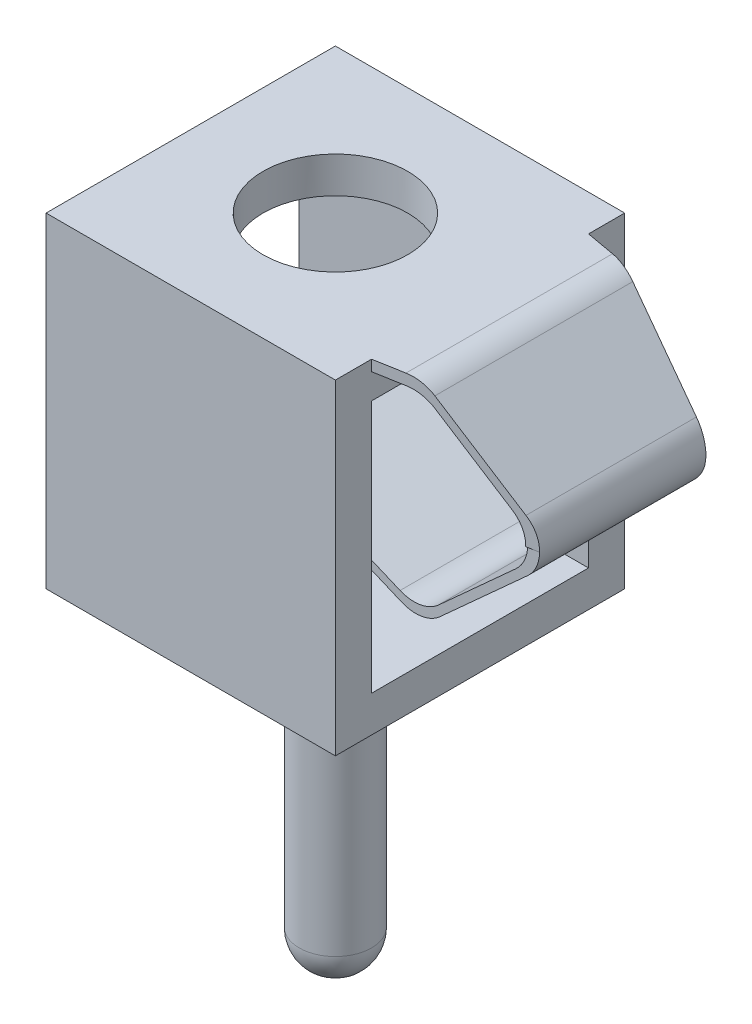
ISO-10303-21;
HEADER;
FILE_DESCRIPTION(('STEP AP214'),'2;1');
FILE_NAME('part.step','',(''),(''),'','','');
FILE_SCHEMA(('AUTOMOTIVE_DESIGN { 1 0 10303 214 1 1 1 1 }'));
ENDSEC;
DATA;
#1=APPLICATION_CONTEXT('core data for automotive mechanical design processes');
#2=APPLICATION_PROTOCOL_DEFINITION('international standard','automotive_design',2000,#1);
#3=PRODUCT_CONTEXT('',#1,'mechanical');
#4=PRODUCT('Part','Part','',(#3));
#5=PRODUCT_RELATED_PRODUCT_CATEGORY('part','',(#4));
#6=PRODUCT_DEFINITION_FORMATION('','',#4);
#7=PRODUCT_DEFINITION_CONTEXT('part definition',#1,'design');
#8=PRODUCT_DEFINITION('design','',#6,#7);
#9=PRODUCT_DEFINITION_SHAPE('','',#8);
#10=(LENGTH_UNIT() NAMED_UNIT(*) SI_UNIT(.MILLI.,.METRE.));
#11=(NAMED_UNIT(*) PLANE_ANGLE_UNIT() SI_UNIT($,.RADIAN.));
#12=(NAMED_UNIT(*) SI_UNIT($,.STERADIAN.) SOLID_ANGLE_UNIT());
#13=UNCERTAINTY_MEASURE_WITH_UNIT(LENGTH_MEASURE(1.E-05),#10,'distance_accuracy_value','');
#14=(GEOMETRIC_REPRESENTATION_CONTEXT(3) GLOBAL_UNCERTAINTY_ASSIGNED_CONTEXT((#13)) GLOBAL_UNIT_ASSIGNED_CONTEXT((#10,
#11,#12)) REPRESENTATION_CONTEXT('',''));
#15=CARTESIAN_POINT('',(0.,0.,0.));
#16=DIRECTION('',(0.,0.,1.));
#17=DIRECTION('',(1.,0.,0.));
#18=AXIS2_PLACEMENT_3D('',#15,#16,#17);
#19=CARTESIAN_POINT('',(5.47325224870173,0.758594498832904,-6.85820493129034));
#20=DIRECTION('',(0.,0.,1.));
#21=DIRECTION('',(1.,0.,0.));
#22=AXIS2_PLACEMENT_3D('',#19,#20,#21);
#23=CYLINDRICAL_SURFACE('',#22,0.500000000000002);
#24=DIRECTION('',(0.,0.,1.));
#25=VECTOR('',#24,1.);
#26=CARTESIAN_POINT('',(5.80889638246924,0.387996312831595,-6.85820493129034));
#27=LINE('',#26,#25);
#28=CARTESIAN_POINT('',(5.80889638246924,0.387996312831597,-1.15001310263475));
#29=VERTEX_POINT('',#28);
#30=CARTESIAN_POINT('',(5.80889638246924,0.387996312831597,1.15001310263475));
#31=VERTEX_POINT('',#30);
#32=EDGE_CURVE('E246',#29,#31,#27,.T.);
#33=ORIENTED_EDGE('',*,*,#32,.F.);
#34=CARTESIAN_POINT('',(5.47325224870173,0.758594498832904,-1.15001310263475));
#35=DIRECTION('',(0.,0.,-1.));
#36=DIRECTION('',(0.,1.,0.));
#37=AXIS2_PLACEMENT_3D('',#34,#35,#36);
#38=CIRCLE('',#37,0.500000000000002);
#39=CARTESIAN_POINT('',(5.97317837783464,0.75,-1.15001310263475));
#40=VERTEX_POINT('',#39);
#41=EDGE_CURVE('E234',#29,#40,#38,.F.);
#42=ORIENTED_EDGE('',*,*,#41,.T.);
#43=CARTESIAN_POINT('',(5.47325224870173,0.758594498832904,-1.23868607655972));
#44=DIRECTION('',(-0.174646166467987,0.,0.984631259171694));
#45=DIRECTION('',(0.984631259171694,0.,0.174646166467987));
#46=AXIS2_PLACEMENT_3D('',#43,#44,#45);
#47=ELLIPSE('',#46,0.507804312876091,0.500000000000002);
#48=CARTESIAN_POINT('',(5.81318688294126,1.12526116549957,-1.17839113856479));
#49=VERTEX_POINT('',#48);
#50=EDGE_CURVE('E243',#49,#40,#47,.F.);
#51=ORIENTED_EDGE('',*,*,#50,.F.);
#52=DIRECTION('',(0.,0.,1.));
#53=VECTOR('',#52,1.);
#54=CARTESIAN_POINT('',(5.81318688294126,1.12526116549957,-6.85820493129034));
#55=LINE('',#54,#53);
#56=CARTESIAN_POINT('',(5.81318688294126,1.12526116549957,1.17839113856479));
#57=VERTEX_POINT('',#56);
#58=EDGE_CURVE('E273',#49,#57,#55,.T.);
#59=ORIENTED_EDGE('',*,*,#58,.T.);
#60=CARTESIAN_POINT('',(5.47325224870173,0.758594498832904,1.23868607655972));
#61=DIRECTION('',(-0.174646166467987,0.,-0.984631259171694));
#62=DIRECTION('',(-0.984631259171694,0.,0.174646166467987));
#63=AXIS2_PLACEMENT_3D('',#60,#61,#62);
#64=ELLIPSE('',#63,0.507804312876091,0.500000000000002);
#65=CARTESIAN_POINT('',(5.97317837783464,0.75,1.15001310263475));
#66=VERTEX_POINT('',#65);
#67=EDGE_CURVE('E512',#66,#57,#64,.F.);
#68=ORIENTED_EDGE('',*,*,#67,.F.);
#69=CARTESIAN_POINT('',(5.47325224870173,0.758594498832904,1.15001310263475));
#70=DIRECTION('',(0.,0.,1.));
#71=DIRECTION('',(0.,-1.,0.));
#72=AXIS2_PLACEMENT_3D('',#69,#70,#71);
#73=CIRCLE('',#72,0.500000000000002);
#74=EDGE_CURVE('E531',#66,#31,#73,.F.);
#75=ORIENTED_EDGE('',*,*,#74,.T.);
#76=EDGE_LOOP('',(#33,#42,#51,#59,#68,#75));
#77=FACE_BOUND('',#76,.T.);
#78=ADVANCED_FACE('F36',(#77),#23,.T.);
#79=CARTESIAN_POINT('',(5.80889638246924,0.387996312831597,-6.85820493129034));
#80=DIRECTION('',(0.671288267535008,-0.741196372002621,0.));
#81=DIRECTION('',(0.741196372002621,0.671288267535008,0.));
#82=AXIS2_PLACEMENT_3D('',#79,#80,#81);
#83=PLANE('',#82);
#84=DIRECTION('',(0.,0.,1.));
#85=VECTOR('',#84,1.);
#86=CARTESIAN_POINT('',(4.59643948633741,-0.710104163653645,-6.85820493129034));
#87=LINE('',#86,#85);
#88=CARTESIAN_POINT('',(4.59643948633741,-0.710104163653642,-1.15001310263475));
#89=VERTEX_POINT('',#88);
#90=CARTESIAN_POINT('',(4.59643948633741,-0.710104163653642,1.15001310263475));
#91=VERTEX_POINT('',#90);
#92=EDGE_CURVE('E276',#89,#91,#87,.T.);
#93=ORIENTED_EDGE('',*,*,#92,.F.);
#94=DIRECTION('',(0.741196372002621,0.671288267535008,0.));
#95=VECTOR('',#94,1.);
#96=CARTESIAN_POINT('',(5.80889638246924,0.387996312831596,-1.15001310263475));
#97=LINE('',#96,#95);
#98=EDGE_CURVE('E247',#89,#29,#97,.T.);
#99=ORIENTED_EDGE('',*,*,#98,.T.);
#100=ORIENTED_EDGE('',*,*,#32,.T.);
#101=DIRECTION('',(-0.741196372002621,-0.671288267535008,0.));
#102=VECTOR('',#101,1.);
#103=CARTESIAN_POINT('',(5.80889638246924,0.387996312831596,1.15001310263475));
#104=LINE('',#103,#102);
#105=EDGE_CURVE('E533',#31,#91,#104,.T.);
#106=ORIENTED_EDGE('',*,*,#105,.T.);
#107=EDGE_LOOP('',(#93,#99,#100,#106));
#108=FACE_BOUND('',#107,.T.);
#109=ADVANCED_FACE('F383',(#108),#83,.T.);
#110=CARTESIAN_POINT('',(4.2607953525699,-0.339505977652333,-6.85820493129034));
#111=DIRECTION('',(0.,0.,1.));
#112=DIRECTION('',(1.,0.,0.));
#113=AXIS2_PLACEMENT_3D('',#110,#111,#112);
#114=CYLINDRICAL_SURFACE('',#113,0.500000000000002);
#115=DIRECTION('',(0.,0.,1.));
#116=VECTOR('',#115,1.);
#117=CARTESIAN_POINT('',(4.06676867111155,-0.800324430931128,-6.85820493129034));
#118=LINE('',#117,#116);
#119=CARTESIAN_POINT('',(4.06676867111155,-0.800324430931124,-1.15001310263475));
#120=VERTEX_POINT('',#119);
#121=CARTESIAN_POINT('',(4.06676867111155,-0.800324430931124,1.15001310263475));
#122=VERTEX_POINT('',#121);
#123=EDGE_CURVE('E278',#120,#122,#118,.T.);
#124=ORIENTED_EDGE('',*,*,#123,.F.);
#125=CARTESIAN_POINT('',(4.2607953525699,-0.339505977652333,-1.15001310263475));
#126=DIRECTION('',(0.,0.,-1.));
#127=DIRECTION('',(0.,1.,0.));
#128=AXIS2_PLACEMENT_3D('',#125,#126,#127);
#129=CIRCLE('',#128,0.500000000000002);
#130=EDGE_CURVE('E561',#120,#89,#129,.F.);
#131=ORIENTED_EDGE('',*,*,#130,.T.);
#132=ORIENTED_EDGE('',*,*,#92,.T.);
#133=CARTESIAN_POINT('',(4.2607953525699,-0.339505977652333,1.15001310263475));
#134=DIRECTION('',(0.,0.,1.));
#135=DIRECTION('',(0.,-1.,0.));
#136=AXIS2_PLACEMENT_3D('',#133,#134,#135);
#137=CIRCLE('',#136,0.500000000000002);
#138=EDGE_CURVE('E538',#91,#122,#137,.F.);
#139=ORIENTED_EDGE('',*,*,#138,.T.);
#140=EDGE_LOOP('',(#124,#131,#132,#139));
#141=FACE_BOUND('',#140,.T.);
#142=ADVANCED_FACE('F388',(#141),#114,.T.);
#143=CARTESIAN_POINT('',(4.06676867111155,-0.800324430931125,-6.85820493129034));
#144=DIRECTION('',(-0.38805336291672,-0.921636906557579,0.));
#145=DIRECTION('',(0.921636906557579,-0.38805336291672,0.));
#146=AXIS2_PLACEMENT_3D('',#143,#144,#145);
#147=PLANE('',#146);
#148=DIRECTION('',(0.,0.,1.));
#149=VECTOR('',#148,1.);
#150=CARTESIAN_POINT('',(1.59543168365403,0.240227029258746,-6.85820493129034));
#151=LINE('',#150,#149);
#152=CARTESIAN_POINT('',(1.59543168365403,0.240227029258746,-1.15001310263475));
#153=VERTEX_POINT('',#152);
#154=CARTESIAN_POINT('',(1.59543168365403,0.240227029258746,1.15001310263475));
#155=VERTEX_POINT('',#154);
#156=EDGE_CURVE('E280',#153,#155,#151,.T.);
#157=ORIENTED_EDGE('',*,*,#156,.F.);
#158=DIRECTION('',(0.921636906557579,-0.38805336291672,0.));
#159=VECTOR('',#158,1.);
#160=CARTESIAN_POINT('',(4.06676867111155,-0.800324430931125,-1.15001310263475));
#161=LINE('',#160,#159);
#162=EDGE_CURVE('E564',#153,#120,#161,.T.);
#163=ORIENTED_EDGE('',*,*,#162,.T.);
#164=ORIENTED_EDGE('',*,*,#123,.T.);
#165=DIRECTION('',(-0.921636906557579,0.38805336291672,0.));
#166=VECTOR('',#165,1.);
#167=CARTESIAN_POINT('',(4.06676867111155,-0.800324430931125,1.15001310263475));
#168=LINE('',#167,#166);
#169=EDGE_CURVE('E541',#122,#155,#168,.T.);
#170=ORIENTED_EDGE('',*,*,#169,.T.);
#171=EDGE_LOOP('',(#157,#163,#164,#170));
#172=FACE_BOUND('',#171,.T.);
#173=ADVANCED_FACE('F397',(#172),#147,.T.);
#174=CARTESIAN_POINT('',(1.59543168365403,0.359579888521796,-6.85820493129034));
#175=DIRECTION('',(-1.,0.,0.));
#176=DIRECTION('',(0.,0.,1.));
#177=AXIS2_PLACEMENT_3D('',#174,#175,#176);
#178=PLANE('',#177);
#179=DIRECTION('',(0.,0.,1.));
#180=VECTOR('',#179,1.);
#181=CARTESIAN_POINT('',(1.59543168365403,0.359579888521796,-6.85820493129034));
#182=LINE('',#181,#180);
#183=CARTESIAN_POINT('',(1.59543168365403,0.359579888521796,-1.15001310263475));
#184=VERTEX_POINT('',#183);
#185=CARTESIAN_POINT('',(1.59543168365403,0.359579888521796,1.15001310263475));
#186=VERTEX_POINT('',#185);
#187=EDGE_CURVE('E282',#184,#186,#182,.T.);
#188=ORIENTED_EDGE('',*,*,#187,.F.);
#189=DIRECTION('',(0.,-1.,0.));
#190=VECTOR('',#189,1.);
#191=CARTESIAN_POINT('',(1.59543168365403,0.359579888521796,-1.15001310263475));
#192=LINE('',#191,#190);
#193=EDGE_CURVE('E567',#184,#153,#192,.T.);
#194=ORIENTED_EDGE('',*,*,#193,.T.);
#195=ORIENTED_EDGE('',*,*,#156,.T.);
#196=DIRECTION('',(0.,1.,0.));
#197=VECTOR('',#196,1.);
#198=CARTESIAN_POINT('',(1.59543168365403,0.359579888521795,1.15001310263475));
#199=LINE('',#198,#197);
#200=EDGE_CURVE('E544',#155,#186,#199,.T.);
#201=ORIENTED_EDGE('',*,*,#200,.T.);
#202=EDGE_LOOP('',(#188,#194,#195,#201));
#203=FACE_BOUND('',#202,.T.);
#204=ADVANCED_FACE('F401',(#203),#178,.T.);
#205=CARTESIAN_POINT('',(4.04486831994504,-0.671750472926527,-6.85820493129034));
#206=DIRECTION('',(0.38805336291672,0.92163690655758,0.));
#207=DIRECTION('',(-0.92163690655758,0.38805336291672,0.));
#208=AXIS2_PLACEMENT_3D('',#205,#206,#207);
#209=PLANE('',#208);
#210=DIRECTION('',(0.,0.,1.));
#211=VECTOR('',#210,1.);
#212=CARTESIAN_POINT('',(4.04486831994504,-0.671750472926527,-6.85820493129034));
#213=LINE('',#212,#211);
#214=CARTESIAN_POINT('',(4.04486831994504,-0.671750472926531,-1.15001310263475));
#215=VERTEX_POINT('',#214);
#216=CARTESIAN_POINT('',(4.04486831994504,-0.67175047292653,1.15001310263475));
#217=VERTEX_POINT('',#216);
#218=EDGE_CURVE('E284',#215,#217,#213,.T.);
#219=ORIENTED_EDGE('',*,*,#218,.F.);
#220=DIRECTION('',(-0.92163690655758,0.38805336291672,0.));
#221=VECTOR('',#220,1.);
#222=CARTESIAN_POINT('',(4.04486831994504,-0.671750472926527,-1.15001310263475));
#223=LINE('',#222,#221);
#224=EDGE_CURVE('E570',#215,#184,#223,.T.);
#225=ORIENTED_EDGE('',*,*,#224,.T.);
#226=ORIENTED_EDGE('',*,*,#187,.T.);
#227=DIRECTION('',(0.92163690655758,-0.38805336291672,0.));
#228=VECTOR('',#227,1.);
#229=CARTESIAN_POINT('',(4.04486831994504,-0.671750472926527,1.15001310263475));
#230=LINE('',#229,#228);
#231=EDGE_CURVE('E547',#186,#217,#230,.T.);
#232=ORIENTED_EDGE('',*,*,#231,.T.);
#233=EDGE_LOOP('',(#219,#225,#226,#232));
#234=FACE_BOUND('',#233,.T.);
#235=ADVANCED_FACE('F405',(#234),#209,.T.);
#236=CARTESIAN_POINT('',(4.23889500140339,-0.210932019647736,-6.85820493129034));
#237=DIRECTION('',(0.,0.,1.));
#238=DIRECTION('',(1.,0.,0.));
#239=AXIS2_PLACEMENT_3D('',#236,#237,#238);
#240=CYLINDRICAL_SURFACE('',#239,0.500000000000002);
#241=DIRECTION('',(0.,0.,1.));
#242=VECTOR('',#241,1.);
#243=CARTESIAN_POINT('',(4.5745391351709,-0.581530205649044,-6.85820493129034));
#244=LINE('',#243,#242);
#245=CARTESIAN_POINT('',(4.5745391351709,-0.58153020564905,-1.15001310263475));
#246=VERTEX_POINT('',#245);
#247=CARTESIAN_POINT('',(4.5745391351709,-0.58153020564905,1.15001310263475));
#248=VERTEX_POINT('',#247);
#249=EDGE_CURVE('E286',#246,#248,#244,.T.);
#250=ORIENTED_EDGE('',*,*,#249,.F.);
#251=CARTESIAN_POINT('',(4.23889500140339,-0.210932019647736,-1.15001310263475));
#252=DIRECTION('',(0.,0.,-1.));
#253=DIRECTION('',(0.,1.,0.));
#254=AXIS2_PLACEMENT_3D('',#251,#252,#253);
#255=CIRCLE('',#254,0.500000000000002);
#256=EDGE_CURVE('E573',#246,#215,#255,.T.);
#257=ORIENTED_EDGE('',*,*,#256,.T.);
#258=ORIENTED_EDGE('',*,*,#218,.T.);
#259=CARTESIAN_POINT('',(4.23889500140339,-0.210932019647736,1.15001310263475));
#260=DIRECTION('',(0.,0.,1.));
#261=DIRECTION('',(0.,-1.,0.));
#262=AXIS2_PLACEMENT_3D('',#259,#260,#261);
#263=CIRCLE('',#262,0.500000000000002);
#264=EDGE_CURVE('E550',#217,#248,#263,.T.);
#265=ORIENTED_EDGE('',*,*,#264,.T.);
#266=EDGE_LOOP('',(#250,#257,#258,#265));
#267=FACE_BOUND('',#266,.T.);
#268=ADVANCED_FACE('F409',(#267),#240,.F.);
#269=CARTESIAN_POINT('',(5.64607854385029,0.388943828518693,-6.85820493129034));
#270=DIRECTION('',(-0.671288267535009,0.74119637200262,0.));
#271=DIRECTION('',(-0.74119637200262,-0.671288267535009,0.));
#272=AXIS2_PLACEMENT_3D('',#269,#270,#271);
#273=PLANE('',#272);
#274=DIRECTION('',(0.,0.,1.));
#275=VECTOR('',#274,1.);
#276=CARTESIAN_POINT('',(5.64607854385029,0.388943828518693,-6.85820493129034));
#277=LINE('',#276,#275);
#278=CARTESIAN_POINT('',(5.64607854385029,0.388943828518692,-1.15001310263475));
#279=VERTEX_POINT('',#278);
#280=CARTESIAN_POINT('',(5.64607854385029,0.388943828518692,1.15001310263475));
#281=VERTEX_POINT('',#280);
#282=EDGE_CURVE('E288',#279,#281,#277,.T.);
#283=ORIENTED_EDGE('',*,*,#282,.F.);
#284=DIRECTION('',(-0.74119637200262,-0.671288267535009,0.));
#285=VECTOR('',#284,1.);
#286=CARTESIAN_POINT('',(5.64607854385029,0.388943828518692,-1.15001310263475));
#287=LINE('',#286,#285);
#288=EDGE_CURVE('E576',#279,#246,#287,.T.);
#289=ORIENTED_EDGE('',*,*,#288,.T.);
#290=ORIENTED_EDGE('',*,*,#249,.T.);
#291=DIRECTION('',(0.74119637200262,0.671288267535009,0.));
#292=VECTOR('',#291,1.);
#293=CARTESIAN_POINT('',(5.64607854385029,0.388943828518692,1.15001310263475));
#294=LINE('',#293,#292);
#295=EDGE_CURVE('E553',#248,#281,#294,.T.);
#296=ORIENTED_EDGE('',*,*,#295,.T.);
#297=EDGE_LOOP('',(#283,#289,#290,#296));
#298=FACE_BOUND('',#297,.T.);
#299=ADVANCED_FACE('F377',(#298),#273,.T.);
#300=CARTESIAN_POINT('',(5.31043441008278,0.759542014520001,-6.85820493129034));
#301=DIRECTION('',(0.,0.,1.));
#302=DIRECTION('',(1.,0.,0.));
#303=AXIS2_PLACEMENT_3D('',#300,#301,#302);
#304=CYLINDRICAL_SURFACE('',#303,0.500000000000002);
#305=DIRECTION('',(0.,0.,1.));
#306=VECTOR('',#305,1.);
#307=CARTESIAN_POINT('',(5.81034335175007,0.75,-6.85820493129034));
#308=LINE('',#307,#306);
#309=CARTESIAN_POINT('',(5.81034335175007,0.75,-1.17889550181463));
#310=VERTEX_POINT('',#309);
#311=CARTESIAN_POINT('',(5.81034335175007,0.75,-1.15001310263475));
#312=VERTEX_POINT('',#311);
#313=EDGE_CURVE('E224',#310,#312,#308,.T.);
#314=ORIENTED_EDGE('',*,*,#313,.T.);
#315=CARTESIAN_POINT('',(5.31043441008278,0.759542014520001,-1.15001310263475));
#316=DIRECTION('',(0.,0.,-1.));
#317=DIRECTION('',(0.,1.,0.));
#318=AXIS2_PLACEMENT_3D('',#315,#316,#317);
#319=CIRCLE('',#318,0.500000000000002);
#320=EDGE_CURVE('E237',#312,#279,#319,.T.);
#321=ORIENTED_EDGE('',*,*,#320,.T.);
#322=ORIENTED_EDGE('',*,*,#282,.T.);
#323=CARTESIAN_POINT('',(5.31043441008278,0.759542014520001,1.15001310263475));
#324=DIRECTION('',(0.,0.,1.));
#325=DIRECTION('',(0.,-1.,0.));
#326=AXIS2_PLACEMENT_3D('',#323,#324,#325);
#327=CIRCLE('',#326,0.500000000000002);
#328=CARTESIAN_POINT('',(5.81034335175007,0.75,1.15001310263475));
#329=VERTEX_POINT('',#328);
#330=EDGE_CURVE('E528',#281,#329,#327,.T.);
#331=ORIENTED_EDGE('',*,*,#330,.T.);
#332=DIRECTION('',(0.,0.,1.));
#333=VECTOR('',#332,1.);
#334=CARTESIAN_POINT('',(5.81034335175007,0.75,-6.85820493129034));
#335=LINE('',#334,#333);
#336=CARTESIAN_POINT('',(5.81034335175007,0.75,1.17889550181463));
#337=VERTEX_POINT('',#336);
#338=EDGE_CURVE('E526',#329,#337,#335,.T.);
#339=ORIENTED_EDGE('',*,*,#338,.T.);
#340=CARTESIAN_POINT('',(5.31043441008278,0.759542014520001,1.26756542716182));
#341=DIRECTION('',(-0.174646166467987,0.,-0.984631259171694));
#342=DIRECTION('',(-0.984631259171694,0.,0.174646166467987));
#343=AXIS2_PLACEMENT_3D('',#340,#341,#342);
#344=ELLIPSE('',#343,0.50780431287609,0.500000000000002);
#345=CARTESIAN_POINT('',(5.65036904432231,1.12620868118667,1.20727048916688));
#346=VERTEX_POINT('',#345);
#347=EDGE_CURVE('E505',#346,#337,#344,.T.);
#348=ORIENTED_EDGE('',*,*,#347,.F.);
#349=DIRECTION('',(0.,0.,1.));
#350=VECTOR('',#349,1.);
#351=CARTESIAN_POINT('',(5.65036904432231,1.12620868118667,-6.85820493129034));
#352=LINE('',#351,#350);
#353=CARTESIAN_POINT('',(5.65036904432231,1.12620868118667,-1.20727048916688));
#354=VERTEX_POINT('',#353);
#355=EDGE_CURVE('E290',#354,#346,#352,.T.);
#356=ORIENTED_EDGE('',*,*,#355,.F.);
#357=CARTESIAN_POINT('',(5.31043441008278,0.759542014520001,-1.26756542716182));
#358=DIRECTION('',(-0.174646166467987,0.,0.984631259171694));
#359=DIRECTION('',(0.984631259171694,0.,0.174646166467987));
#360=AXIS2_PLACEMENT_3D('',#357,#358,#359);
#361=ELLIPSE('',#360,0.50780431287609,0.500000000000002);
#362=EDGE_CURVE('E252',#310,#354,#361,.T.);
#363=ORIENTED_EDGE('',*,*,#362,.F.);
#364=EDGE_LOOP('',(#314,#321,#322,#331,#339,#348,#356,#363));
#365=FACE_BOUND('',#364,.T.);
#366=ADVANCED_FACE('F367',(#365),#304,.F.);
#367=CARTESIAN_POINT('',(4.,-2.25,2.));
#368=DIRECTION('',(0.,1.,0.));
#369=DIRECTION('',(0.,0.,1.));
#370=AXIS2_PLACEMENT_3D('',#367,#368,#369);
#371=PLANE('',#370);
#372=DIRECTION('',(0.,0.,-1.));
#373=VECTOR('',#372,1.);
#374=CARTESIAN_POINT('',(0.,-2.25,2.));
#375=LINE('',#374,#373);
#376=CARTESIAN_POINT('',(0.,-2.25,2.));
#377=VERTEX_POINT('',#376);
#378=CARTESIAN_POINT('',(0.,-2.25,-2.));
#379=VERTEX_POINT('',#378);
#380=EDGE_CURVE('E332',#377,#379,#375,.T.);
#381=ORIENTED_EDGE('',*,*,#380,.T.);
#382=DIRECTION('',(-1.,0.,0.));
#383=VECTOR('',#382,1.);
#384=CARTESIAN_POINT('',(4.,-2.25,-2.));
#385=LINE('',#384,#383);
#386=CARTESIAN_POINT('',(4.,-2.25,-2.));
#387=VERTEX_POINT('',#386);
#388=EDGE_CURVE('E340',#387,#379,#385,.T.);
#389=ORIENTED_EDGE('',*,*,#388,.F.);
#390=DIRECTION('',(0.,0.,-1.));
#391=VECTOR('',#390,1.);
#392=CARTESIAN_POINT('',(4.,-2.25,2.));
#393=LINE('',#392,#391);
#394=CARTESIAN_POINT('',(4.,-2.25,2.));
#395=VERTEX_POINT('',#394);
#396=EDGE_CURVE('E338',#395,#387,#393,.T.);
#397=ORIENTED_EDGE('',*,*,#396,.F.);
#398=DIRECTION('',(-1.,0.,0.));
#399=VECTOR('',#398,1.);
#400=CARTESIAN_POINT('',(4.,-2.25,2.));
#401=LINE('',#400,#399);
#402=EDGE_CURVE('E350',#395,#377,#401,.T.);
#403=ORIENTED_EDGE('',*,*,#402,.T.);
#404=EDGE_LOOP('',(#381,#389,#397,#403));
#405=FACE_BOUND('',#404,.T.);
#406=CARTESIAN_POINT('',(2.,-2.25,0.));
#407=DIRECTION('',(0.,1.,0.));
#408=DIRECTION('',(0.,0.,1.));
#409=AXIS2_PLACEMENT_3D('',#406,#407,#408);
#410=CIRCLE('',#409,0.5);
#411=CARTESIAN_POINT('',(2.,-2.25,0.5));
#412=VERTEX_POINT('',#411);
#413=EDGE_CURVE('E45',#412,#412,#410,.F.);
#414=ORIENTED_EDGE('',*,*,#413,.F.);
#415=EDGE_LOOP('',(#414));
#416=FACE_BOUND('',#415,.T.);
#417=ADVANCED_FACE('F364',(#405,#416),#371,.F.);
#418=CARTESIAN_POINT('',(4.,0.,0.));
#419=DIRECTION('',(1.,0.,0.));
#420=DIRECTION('',(0.,0.,-1.));
#421=AXIS2_PLACEMENT_3D('',#418,#419,#420);
#422=PLANE('',#421);
#423=DIRECTION('',(0.,0.,1.));
#424=VECTOR('',#423,1.);
#425=CARTESIAN_POINT('',(4.,2.1,-6.85820493129034));
#426=LINE('',#425,#424);
#427=CARTESIAN_POINT('',(4.,2.1,-1.5));
#428=VERTEX_POINT('',#427);
#429=CARTESIAN_POINT('',(4.,2.1,1.5));
#430=VERTEX_POINT('',#429);
#431=EDGE_CURVE('E267',#428,#430,#426,.T.);
#432=ORIENTED_EDGE('',*,*,#431,.T.);
#433=DIRECTION('',(0.,-1.,0.));
#434=VECTOR('',#433,1.);
#435=CARTESIAN_POINT('',(4.,2.25,1.5));
#436=LINE('',#435,#434);
#437=CARTESIAN_POINT('',(4.,2.25,1.5));
#438=VERTEX_POINT('',#437);
#439=EDGE_CURVE('E261',#438,#430,#436,.T.);
#440=ORIENTED_EDGE('',*,*,#439,.F.);
#441=DIRECTION('',(0.,0.,1.));
#442=VECTOR('',#441,1.);
#443=CARTESIAN_POINT('',(4.,2.25,2.));
#444=LINE('',#443,#442);
#445=CARTESIAN_POINT('',(4.,2.25,2.));
#446=VERTEX_POINT('',#445);
#447=EDGE_CURVE('E331',#438,#446,#444,.T.);
#448=ORIENTED_EDGE('',*,*,#447,.T.);
#449=DIRECTION('',(0.,-1.,0.));
#450=VECTOR('',#449,1.);
#451=CARTESIAN_POINT('',(4.,2.25,2.));
#452=LINE('',#451,#450);
#453=EDGE_CURVE('E336',#446,#395,#452,.T.);
#454=ORIENTED_EDGE('',*,*,#453,.T.);
#455=ORIENTED_EDGE('',*,*,#396,.T.);
#456=DIRECTION('',(0.,1.,0.));
#457=VECTOR('',#456,1.);
#458=CARTESIAN_POINT('',(4.,2.25,-2.));
#459=LINE('',#458,#457);
#460=CARTESIAN_POINT('',(4.,2.25,-2.));
#461=VERTEX_POINT('',#460);
#462=EDGE_CURVE('E328',#387,#461,#459,.T.);
#463=ORIENTED_EDGE('',*,*,#462,.T.);
#464=CARTESIAN_POINT('',(4.,2.25,-1.5));
#465=VERTEX_POINT('',#464);
#466=EDGE_CURVE('E333',#461,#465,#444,.T.);
#467=ORIENTED_EDGE('',*,*,#466,.T.);
#468=DIRECTION('',(0.,1.,0.));
#469=VECTOR('',#468,1.);
#470=CARTESIAN_POINT('',(4.,2.25,-1.5));
#471=LINE('',#470,#469);
#472=EDGE_CURVE('E262',#428,#465,#471,.T.);
#473=ORIENTED_EDGE('',*,*,#472,.F.);
#474=EDGE_LOOP('',(#432,#440,#448,#454,#455,#463,#467,#473));
#475=FACE_BOUND('',#474,.T.);
#476=DIRECTION('',(0.,0.,1.));
#477=VECTOR('',#476,1.);
#478=CARTESIAN_POINT('',(4.,1.75,1.5));
#479=LINE('',#478,#477);
#480=CARTESIAN_POINT('',(4.,1.75,-1.5));
#481=VERTEX_POINT('',#480);
#482=CARTESIAN_POINT('',(4.,1.75,1.5));
#483=VERTEX_POINT('',#482);
#484=EDGE_CURVE('E305',#481,#483,#479,.T.);
#485=ORIENTED_EDGE('',*,*,#484,.F.);
#486=DIRECTION('',(0.,1.,0.));
#487=VECTOR('',#486,1.);
#488=CARTESIAN_POINT('',(4.,1.75,-1.5));
#489=LINE('',#488,#487);
#490=CARTESIAN_POINT('',(4.,-1.75,-1.5));
#491=VERTEX_POINT('',#490);
#492=EDGE_CURVE('E303',#491,#481,#489,.T.);
#493=ORIENTED_EDGE('',*,*,#492,.F.);
#494=DIRECTION('',(0.,0.,-1.));
#495=VECTOR('',#494,1.);
#496=CARTESIAN_POINT('',(4.,-1.75,1.5));
#497=LINE('',#496,#495);
#498=CARTESIAN_POINT('',(4.,-1.75,1.5));
#499=VERTEX_POINT('',#498);
#500=EDGE_CURVE('E309',#499,#491,#497,.T.);
#501=ORIENTED_EDGE('',*,*,#500,.F.);
#502=DIRECTION('',(0.,-1.,0.));
#503=VECTOR('',#502,1.);
#504=CARTESIAN_POINT('',(4.,1.75,1.5));
#505=LINE('',#504,#503);
#506=EDGE_CURVE('E52',#483,#499,#505,.T.);
#507=ORIENTED_EDGE('',*,*,#506,.F.);
#508=EDGE_LOOP('',(#485,#493,#501,#507));
#509=FACE_BOUND('',#508,.T.);
#510=ADVANCED_FACE('F366',(#475,#509),#422,.T.);
#511=CARTESIAN_POINT('',(0.,0.,0.));
#512=DIRECTION('',(1.,0.,0.));
#513=DIRECTION('',(0.,0.,-1.));
#514=AXIS2_PLACEMENT_3D('',#511,#512,#513);
#515=PLANE('',#514);
#516=DIRECTION('',(0.,1.,0.));
#517=VECTOR('',#516,1.);
#518=CARTESIAN_POINT('',(0.,2.25,-2.));
#519=LINE('',#518,#517);
#520=CARTESIAN_POINT('',(0.,2.25,-2.));
#521=VERTEX_POINT('',#520);
#522=EDGE_CURVE('E327',#379,#521,#519,.T.);
#523=ORIENTED_EDGE('',*,*,#522,.F.);
#524=ORIENTED_EDGE('',*,*,#380,.F.);
#525=DIRECTION('',(0.,-1.,0.));
#526=VECTOR('',#525,1.);
#527=CARTESIAN_POINT('',(0.,2.25,2.));
#528=LINE('',#527,#526);
#529=CARTESIAN_POINT('',(0.,2.25,2.));
#530=VERTEX_POINT('',#529);
#531=EDGE_CURVE('E345',#530,#377,#528,.T.);
#532=ORIENTED_EDGE('',*,*,#531,.F.);
#533=DIRECTION('',(0.,0.,1.));
#534=VECTOR('',#533,1.);
#535=CARTESIAN_POINT('',(0.,2.25,2.));
#536=LINE('',#535,#534);
#537=EDGE_CURVE('E343',#521,#530,#536,.T.);
#538=ORIENTED_EDGE('',*,*,#537,.F.);
#539=EDGE_LOOP('',(#523,#524,#532,#538));
#540=FACE_BOUND('',#539,.T.);
#541=DIRECTION('',(0.,1.,0.));
#542=VECTOR('',#541,1.);
#543=CARTESIAN_POINT('',(0.,1.75,-1.5));
#544=LINE('',#543,#542);
#545=CARTESIAN_POINT('',(0.,-1.75,-1.5));
#546=VERTEX_POINT('',#545);
#547=CARTESIAN_POINT('',(0.,1.75,-1.5));
#548=VERTEX_POINT('',#547);
#549=EDGE_CURVE('E60',#546,#548,#544,.T.);
#550=ORIENTED_EDGE('',*,*,#549,.T.);
#551=DIRECTION('',(0.,0.,1.));
#552=VECTOR('',#551,1.);
#553=CARTESIAN_POINT('',(0.,1.75,1.5));
#554=LINE('',#553,#552);
#555=CARTESIAN_POINT('',(0.,1.75,1.5));
#556=VERTEX_POINT('',#555);
#557=EDGE_CURVE('E313',#548,#556,#554,.T.);
#558=ORIENTED_EDGE('',*,*,#557,.T.);
#559=DIRECTION('',(0.,-1.,0.));
#560=VECTOR('',#559,1.);
#561=CARTESIAN_POINT('',(0.,1.75,1.5));
#562=LINE('',#561,#560);
#563=CARTESIAN_POINT('',(0.,-1.75,1.5));
#564=VERTEX_POINT('',#563);
#565=EDGE_CURVE('E316',#556,#564,#562,.T.);
#566=ORIENTED_EDGE('',*,*,#565,.T.);
#567=DIRECTION('',(0.,0.,-1.));
#568=VECTOR('',#567,1.);
#569=CARTESIAN_POINT('',(0.,-1.75,1.5));
#570=LINE('',#569,#568);
#571=EDGE_CURVE('E306',#564,#546,#570,.T.);
#572=ORIENTED_EDGE('',*,*,#571,.T.);
#573=EDGE_LOOP('',(#550,#558,#566,#572));
#574=FACE_BOUND('',#573,.T.);
#575=ADVANCED_FACE('F374',(#540,#574),#515,.F.);
#576=CARTESIAN_POINT('',(4.,2.25,-2.));
#577=DIRECTION('',(0.,0.,1.));
#578=DIRECTION('',(0.,-1.,0.));
#579=AXIS2_PLACEMENT_3D('',#576,#577,#578);
#580=PLANE('',#579);
#581=ORIENTED_EDGE('',*,*,#522,.T.);
#582=DIRECTION('',(-1.,0.,0.));
#583=VECTOR('',#582,1.);
#584=CARTESIAN_POINT('',(4.,2.25,-2.));
#585=LINE('',#584,#583);
#586=EDGE_CURVE('E356',#461,#521,#585,.T.);
#587=ORIENTED_EDGE('',*,*,#586,.F.);
#588=ORIENTED_EDGE('',*,*,#462,.F.);
#589=ORIENTED_EDGE('',*,*,#388,.T.);
#590=EDGE_LOOP('',(#581,#587,#588,#589));
#591=FACE_BOUND('',#590,.T.);
#592=ADVANCED_FACE('F452',(#591),#580,.F.);
#593=CARTESIAN_POINT('',(4.,2.25,2.));
#594=DIRECTION('',(0.,-1.,0.));
#595=DIRECTION('',(0.,0.,-1.));
#596=AXIS2_PLACEMENT_3D('',#593,#594,#595);
#597=PLANE('',#596);
#598=CARTESIAN_POINT('',(2.,2.25,0.));
#599=DIRECTION('',(0.,1.,0.));
#600=DIRECTION('',(0.,0.,1.));
#601=AXIS2_PLACEMENT_3D('',#598,#599,#600);
#602=CIRCLE('',#601,1.);
#603=CARTESIAN_POINT('',(2.,2.25,1.));
#604=VERTEX_POINT('',#603);
#605=EDGE_CURVE('E264',#604,#604,#602,.T.);
#606=ORIENTED_EDGE('',*,*,#605,.F.);
#607=EDGE_LOOP('',(#606));
#608=FACE_BOUND('',#607,.T.);
#609=ORIENTED_EDGE('',*,*,#447,.F.);
#610=DIRECTION('',(-0.984631259171694,0.,0.174646166467987));
#611=VECTOR('',#610,1.);
#612=CARTESIAN_POINT('',(4.,2.25,1.5));
#613=LINE('',#612,#611);
#614=CARTESIAN_POINT('',(4.40388386486181,2.25,1.42836224927926));
#615=VERTEX_POINT('',#614);
#616=EDGE_CURVE('E493',#615,#438,#613,.T.);
#617=ORIENTED_EDGE('',*,*,#616,.F.);
#618=DIRECTION('',(0.,0.,1.));
#619=VECTOR('',#618,1.);
#620=CARTESIAN_POINT('',(4.40388386486181,2.25,-6.85820493129034));
#621=LINE('',#620,#619);
#622=CARTESIAN_POINT('',(4.40388386486181,2.25,-1.42836224927926));
#623=VERTEX_POINT('',#622);
#624=EDGE_CURVE('E265',#623,#615,#621,.T.);
#625=ORIENTED_EDGE('',*,*,#624,.F.);
#626=DIRECTION('',(0.984631259171694,0.,0.174646166467987));
#627=VECTOR('',#626,1.);
#628=CARTESIAN_POINT('',(4.,2.25,-1.5));
#629=LINE('',#628,#627);
#630=EDGE_CURVE('E229',#465,#623,#629,.T.);
#631=ORIENTED_EDGE('',*,*,#630,.F.);
#632=ORIENTED_EDGE('',*,*,#466,.F.);
#633=ORIENTED_EDGE('',*,*,#586,.T.);
#634=ORIENTED_EDGE('',*,*,#537,.T.);
#635=DIRECTION('',(-1.,0.,0.));
#636=VECTOR('',#635,1.);
#637=CARTESIAN_POINT('',(4.,2.25,2.));
#638=LINE('',#637,#636);
#639=EDGE_CURVE('E353',#446,#530,#638,.T.);
#640=ORIENTED_EDGE('',*,*,#639,.F.);
#641=EDGE_LOOP('',(#609,#617,#625,#631,#632,#633,#634,#640));
#642=FACE_BOUND('',#641,.T.);
#643=ADVANCED_FACE('F457',(#608,#642),#597,.F.);
#644=CARTESIAN_POINT('',(4.,2.25,2.));
#645=DIRECTION('',(0.,0.,-1.));
#646=DIRECTION('',(0.,1.,0.));
#647=AXIS2_PLACEMENT_3D('',#644,#645,#646);
#648=PLANE('',#647);
#649=ORIENTED_EDGE('',*,*,#531,.T.);
#650=ORIENTED_EDGE('',*,*,#402,.F.);
#651=ORIENTED_EDGE('',*,*,#453,.F.);
#652=ORIENTED_EDGE('',*,*,#639,.T.);
#653=EDGE_LOOP('',(#649,#650,#651,#652));
#654=FACE_BOUND('',#653,.T.);
#655=ADVANCED_FACE('F450',(#654),#648,.F.);
#656=CARTESIAN_POINT('',(4.,1.75,-1.5));
#657=DIRECTION('',(0.,0.,1.));
#658=DIRECTION('',(0.,-1.,0.));
#659=AXIS2_PLACEMENT_3D('',#656,#657,#658);
#660=PLANE('',#659);
#661=DIRECTION('',(-1.,0.,0.));
#662=VECTOR('',#661,1.);
#663=CARTESIAN_POINT('',(4.,1.75,-1.5));
#664=LINE('',#663,#662);
#665=EDGE_CURVE('E325',#481,#548,#664,.T.);
#666=ORIENTED_EDGE('',*,*,#665,.T.);
#667=ORIENTED_EDGE('',*,*,#549,.F.);
#668=DIRECTION('',(-1.,0.,0.));
#669=VECTOR('',#668,1.);
#670=CARTESIAN_POINT('',(4.,-1.75,-1.5));
#671=LINE('',#670,#669);
#672=EDGE_CURVE('E311',#491,#546,#671,.T.);
#673=ORIENTED_EDGE('',*,*,#672,.F.);
#674=ORIENTED_EDGE('',*,*,#492,.T.);
#675=EDGE_LOOP('',(#666,#667,#673,#674));
#676=FACE_BOUND('',#675,.T.);
#677=ADVANCED_FACE('F447',(#676),#660,.T.);
#678=CARTESIAN_POINT('',(4.,1.75,1.5));
#679=DIRECTION('',(0.,-1.,0.));
#680=DIRECTION('',(0.,0.,-1.));
#681=AXIS2_PLACEMENT_3D('',#678,#679,#680);
#682=PLANE('',#681);
#683=CARTESIAN_POINT('',(2.,1.75,0.));
#684=DIRECTION('',(0.,-1.,0.));
#685=DIRECTION('',(0.,0.,-1.));
#686=AXIS2_PLACEMENT_3D('',#683,#684,#685);
#687=CIRCLE('',#686,1.);
#688=CARTESIAN_POINT('',(2.,1.75,-1.));
#689=VERTEX_POINT('',#688);
#690=EDGE_CURVE('E40',#689,#689,#687,.T.);
#691=ORIENTED_EDGE('',*,*,#690,.F.);
#692=EDGE_LOOP('',(#691));
#693=FACE_BOUND('',#692,.T.);
#694=ORIENTED_EDGE('',*,*,#557,.F.);
#695=ORIENTED_EDGE('',*,*,#665,.F.);
#696=ORIENTED_EDGE('',*,*,#484,.T.);
#697=DIRECTION('',(-1.,0.,0.));
#698=VECTOR('',#697,1.);
#699=CARTESIAN_POINT('',(4.,1.75,1.5));
#700=LINE('',#699,#698);
#701=EDGE_CURVE('E323',#483,#556,#700,.T.);
#702=ORIENTED_EDGE('',*,*,#701,.T.);
#703=EDGE_LOOP('',(#694,#695,#696,#702));
#704=FACE_BOUND('',#703,.T.);
#705=ADVANCED_FACE('F444',(#693,#704),#682,.T.);
#706=CARTESIAN_POINT('',(4.,1.75,1.5));
#707=DIRECTION('',(0.,0.,-1.));
#708=DIRECTION('',(0.,1.,0.));
#709=AXIS2_PLACEMENT_3D('',#706,#707,#708);
#710=PLANE('',#709);
#711=ORIENTED_EDGE('',*,*,#506,.T.);
#712=DIRECTION('',(-1.,0.,0.));
#713=VECTOR('',#712,1.);
#714=CARTESIAN_POINT('',(4.,-1.75,1.5));
#715=LINE('',#714,#713);
#716=EDGE_CURVE('E321',#499,#564,#715,.T.);
#717=ORIENTED_EDGE('',*,*,#716,.T.);
#718=ORIENTED_EDGE('',*,*,#565,.F.);
#719=ORIENTED_EDGE('',*,*,#701,.F.);
#720=EDGE_LOOP('',(#711,#717,#718,#719));
#721=FACE_BOUND('',#720,.T.);
#722=ADVANCED_FACE('F440',(#721),#710,.T.);
#723=CARTESIAN_POINT('',(4.,-1.75,1.5));
#724=DIRECTION('',(0.,1.,0.));
#725=DIRECTION('',(0.,0.,1.));
#726=AXIS2_PLACEMENT_3D('',#723,#724,#725);
#727=PLANE('',#726);
#728=ORIENTED_EDGE('',*,*,#571,.F.);
#729=ORIENTED_EDGE('',*,*,#716,.F.);
#730=ORIENTED_EDGE('',*,*,#500,.T.);
#731=ORIENTED_EDGE('',*,*,#672,.T.);
#732=EDGE_LOOP('',(#728,#729,#730,#731));
#733=FACE_BOUND('',#732,.T.);
#734=ADVANCED_FACE('F436',(#733),#727,.T.);
#735=CARTESIAN_POINT('',(2.,-6.8,0.));
#736=DIRECTION('',(0.,1.,0.));
#737=DIRECTION('',(0.,0.,1.));
#738=AXIS2_PLACEMENT_3D('',#735,#736,#737);
#739=CYLINDRICAL_SURFACE('',#738,0.5);
#740=CARTESIAN_POINT('',(2.,-6.3,0.));
#741=DIRECTION('',(0.,1.,0.));
#742=DIRECTION('',(0.,0.,1.));
#743=AXIS2_PLACEMENT_3D('',#740,#741,#742);
#744=CIRCLE('',#743,0.5);
#745=CARTESIAN_POINT('',(2.,-6.3,0.5));
#746=VERTEX_POINT('',#745);
#747=EDGE_CURVE('E11',#746,#746,#744,.T.);
#748=ORIENTED_EDGE('',*,*,#747,.T.);
#749=EDGE_LOOP('',(#748));
#750=FACE_BOUND('',#749,.T.);
#751=ORIENTED_EDGE('',*,*,#413,.T.);
#752=EDGE_LOOP('',(#751));
#753=FACE_BOUND('',#752,.T.);
#754=ADVANCED_FACE('F362',(#750,#753),#739,.T.);
#755=CARTESIAN_POINT('',(2.,-6.3,0.));
#756=DIRECTION('',(0.,0.,1.));
#757=DIRECTION('',(1.,0.,0.));
#758=AXIS2_PLACEMENT_3D('',#755,#756,#757);
#759=SPHERICAL_SURFACE('',#758,0.5);
#760=CARTESIAN_POINT('',(2.,-6.3,0.));
#761=DIRECTION('',(0.,1.,0.));
#762=DIRECTION('',(0.,0.,1.));
#763=AXIS2_PLACEMENT_3D('',#760,#761,#762);
#764=SPHERICAL_SURFACE('',#763,0.5);
#765=ORIENTED_EDGE('',*,*,#747,.F.);
#766=EDGE_LOOP('',(#765));
#767=FACE_BOUND('',#766,.T.);
#768=ADVANCED_FACE('F38',(#767),#764,.T.);
#769=CARTESIAN_POINT('',(2.,-0.3,0.));
#770=DIRECTION('',(0.,1.,0.));
#771=DIRECTION('',(0.,0.,1.));
#772=AXIS2_PLACEMENT_3D('',#769,#770,#771);
#773=CYLINDRICAL_SURFACE('',#772,1.);
#774=ORIENTED_EDGE('',*,*,#690,.T.);
#775=EDGE_LOOP('',(#774));
#776=FACE_BOUND('',#775,.T.);
#777=ORIENTED_EDGE('',*,*,#605,.T.);
#778=EDGE_LOOP('',(#777));
#779=FACE_BOUND('',#778,.T.);
#780=ADVANCED_FACE('F429',(#776,#779),#773,.F.);
#781=CARTESIAN_POINT('',(4.40388386486181,1.75,-6.85820493129034));
#782=DIRECTION('',(0.,0.,1.));
#783=DIRECTION('',(1.,0.,0.));
#784=AXIS2_PLACEMENT_3D('',#781,#782,#783);
#785=CYLINDRICAL_SURFACE('',#784,0.5);
#786=CARTESIAN_POINT('',(4.40388386486181,1.75,1.42836224927926));
#787=DIRECTION('',(-0.174646166467987,0.,-0.984631259171694));
#788=DIRECTION('',(-0.984631259171694,0.,0.174646166467987));
#789=AXIS2_PLACEMENT_3D('',#786,#787,#788);
#790=ELLIPSE('',#789,0.507804312876089,0.5);
#791=CARTESIAN_POINT('',(4.74381849910133,2.11666666666666,1.36806731128433));
#792=VERTEX_POINT('',#791);
#793=EDGE_CURVE('E510',#792,#615,#790,.F.);
#794=ORIENTED_EDGE('',*,*,#793,.F.);
#795=DIRECTION('',(0.,0.,1.));
#796=VECTOR('',#795,1.);
#797=CARTESIAN_POINT('',(4.74381849910133,2.11666666666667,-6.85820493129034));
#798=LINE('',#797,#796);
#799=CARTESIAN_POINT('',(4.74381849910133,2.11666666666666,-1.36806731128433));
#800=VERTEX_POINT('',#799);
#801=EDGE_CURVE('E270',#800,#792,#798,.T.);
#802=ORIENTED_EDGE('',*,*,#801,.F.);
#803=CARTESIAN_POINT('',(4.40388386486181,1.75,-1.42836224927926));
#804=DIRECTION('',(-0.174646166467987,0.,0.984631259171694));
#805=DIRECTION('',(0.984631259171694,0.,0.174646166467987));
#806=AXIS2_PLACEMENT_3D('',#803,#804,#805);
#807=ELLIPSE('',#806,0.507804312876089,0.5);
#808=EDGE_CURVE('E254',#623,#800,#807,.F.);
#809=ORIENTED_EDGE('',*,*,#808,.F.);
#810=ORIENTED_EDGE('',*,*,#624,.T.);
#811=EDGE_LOOP('',(#794,#802,#809,#810));
#812=FACE_BOUND('',#811,.T.);
#813=ADVANCED_FACE('F432',(#812),#785,.T.);
#814=CARTESIAN_POINT('',(4.74381849910133,2.11666666666667,-6.85820493129034));
#815=DIRECTION('',(0.679869268479043,0.733333333333329,0.));
#816=DIRECTION('',(-0.733333333333329,0.679869268479043,0.));
#817=AXIS2_PLACEMENT_3D('',#814,#815,#816);
#818=PLANE('',#817);
#819=DIRECTION('',(-0.727207339164334,0.67418989324125,0.128986331511836));
#820=VECTOR('',#819,1.);
#821=CARTESIAN_POINT('',(5.51544124718617,1.40129949400908,1.23120292306058));
#822=LINE('',#821,#820);
#823=EDGE_CURVE('E508',#57,#792,#822,.T.);
#824=ORIENTED_EDGE('',*,*,#823,.F.);
#825=ORIENTED_EDGE('',*,*,#58,.F.);
#826=DIRECTION('',(0.727207339164334,-0.67418989324125,0.128986331511836));
#827=VECTOR('',#826,1.);
#828=CARTESIAN_POINT('',(4.22884465034051,2.59409606736147,-1.45940933163924));
#829=LINE('',#828,#827);
#830=EDGE_CURVE('E251',#800,#49,#829,.T.);
#831=ORIENTED_EDGE('',*,*,#830,.F.);
#832=ORIENTED_EDGE('',*,*,#801,.T.);
#833=EDGE_LOOP('',(#824,#825,#831,#832));
#834=FACE_BOUND('',#833,.T.);
#835=ADVANCED_FACE('F392',(#834),#818,.T.);
#836=CARTESIAN_POINT('',(4.74381849910133,1.96666666666666,-6.85820493129034));
#837=DIRECTION('',(-0.679869268479043,-0.733333333333329,0.));
#838=DIRECTION('',(0.733333333333329,-0.679869268479043,0.));
#839=AXIS2_PLACEMENT_3D('',#836,#837,#838);
#840=PLANE('',#839);
#841=DIRECTION('',(0.727207339164334,-0.67418989324125,-0.128986331511836));
#842=VECTOR('',#841,1.);
#843=CARTESIAN_POINT('',(5.51544124718617,1.25129949400908,1.23120292306058));
#844=LINE('',#843,#842);
#845=CARTESIAN_POINT('',(4.74381849910133,1.96666666666666,1.36806731128433));
#846=VERTEX_POINT('',#845);
#847=EDGE_CURVE('E499',#846,#346,#844,.T.);
#848=ORIENTED_EDGE('',*,*,#847,.F.);
#849=DIRECTION('',(0.,0.,1.));
#850=VECTOR('',#849,1.);
#851=CARTESIAN_POINT('',(4.74381849910133,1.96666666666666,-6.85820493129034));
#852=LINE('',#851,#850);
#853=CARTESIAN_POINT('',(4.74381849910133,1.96666666666666,-1.36806731128433));
#854=VERTEX_POINT('',#853);
#855=EDGE_CURVE('E293',#854,#846,#852,.T.);
#856=ORIENTED_EDGE('',*,*,#855,.F.);
#857=DIRECTION('',(-0.727207339164334,0.67418989324125,-0.128986331511836));
#858=VECTOR('',#857,1.);
#859=CARTESIAN_POINT('',(4.22884465034051,2.44409606736147,-1.45940933163924));
#860=LINE('',#859,#858);
#861=EDGE_CURVE('E256',#354,#854,#860,.T.);
#862=ORIENTED_EDGE('',*,*,#861,.F.);
#863=ORIENTED_EDGE('',*,*,#355,.T.);
#864=EDGE_LOOP('',(#848,#856,#862,#863));
#865=FACE_BOUND('',#864,.T.);
#866=ADVANCED_FACE('F417',(#865),#840,.T.);
#867=CARTESIAN_POINT('',(4.40388386486181,1.6,-6.85820493129034));
#868=DIRECTION('',(0.,0.,1.));
#869=DIRECTION('',(1.,0.,0.));
#870=AXIS2_PLACEMENT_3D('',#867,#868,#869);
#871=CYLINDRICAL_SURFACE('',#870,0.5);
#872=CARTESIAN_POINT('',(4.40388386486181,1.6,1.42836224927926));
#873=DIRECTION('',(-0.174646166467987,0.,-0.984631259171694));
#874=DIRECTION('',(-0.984631259171694,0.,0.174646166467987));
#875=AXIS2_PLACEMENT_3D('',#872,#873,#874);
#876=ELLIPSE('',#875,0.507804312876088,0.5);
#877=CARTESIAN_POINT('',(4.40388386486181,2.1,1.42836224927926));
#878=VERTEX_POINT('',#877);
#879=EDGE_CURVE('E496',#878,#846,#876,.T.);
#880=ORIENTED_EDGE('',*,*,#879,.F.);
#881=DIRECTION('',(0.,0.,1.));
#882=VECTOR('',#881,1.);
#883=CARTESIAN_POINT('',(4.40388386486181,2.1,-6.85820493129034));
#884=LINE('',#883,#882);
#885=CARTESIAN_POINT('',(4.40388386486181,2.1,-1.42836224927926));
#886=VERTEX_POINT('',#885);
#887=EDGE_CURVE('E296',#886,#878,#884,.T.);
#888=ORIENTED_EDGE('',*,*,#887,.F.);
#889=CARTESIAN_POINT('',(4.40388386486181,1.6,-1.42836224927926));
#890=DIRECTION('',(-0.174646166467987,0.,0.984631259171694));
#891=DIRECTION('',(0.984631259171694,0.,0.174646166467987));
#892=AXIS2_PLACEMENT_3D('',#889,#890,#891);
#893=ELLIPSE('',#892,0.507804312876088,0.5);
#894=EDGE_CURVE('E516',#854,#886,#893,.T.);
#895=ORIENTED_EDGE('',*,*,#894,.F.);
#896=ORIENTED_EDGE('',*,*,#855,.T.);
#897=EDGE_LOOP('',(#880,#888,#895,#896));
#898=FACE_BOUND('',#897,.T.);
#899=ADVANCED_FACE('F420',(#898),#871,.F.);
#900=CARTESIAN_POINT('',(4.,2.1,-6.85820493129034));
#901=DIRECTION('',(0.,-1.,0.));
#902=DIRECTION('',(0.,0.,-1.));
#903=AXIS2_PLACEMENT_3D('',#900,#901,#902);
#904=PLANE('',#903);
#905=DIRECTION('',(0.984631259171694,0.,-0.174646166467987));
#906=VECTOR('',#905,1.);
#907=CARTESIAN_POINT('',(5.43729426157895,2.1,1.24506402215753));
#908=LINE('',#907,#906);
#909=EDGE_CURVE('E491',#430,#878,#908,.T.);
#910=ORIENTED_EDGE('',*,*,#909,.F.);
#911=ORIENTED_EDGE('',*,*,#431,.F.);
#912=DIRECTION('',(-0.984631259171694,0.,-0.174646166467987));
#913=VECTOR('',#912,1.);
#914=CARTESIAN_POINT('',(3.0785919628177,2.1,-1.66343212745658));
#915=LINE('',#914,#913);
#916=EDGE_CURVE('E228',#886,#428,#915,.T.);
#917=ORIENTED_EDGE('',*,*,#916,.F.);
#918=ORIENTED_EDGE('',*,*,#887,.T.);
#919=EDGE_LOOP('',(#910,#911,#917,#918));
#920=FACE_BOUND('',#919,.T.);
#921=ADVANCED_FACE('F424',(#920),#904,.T.);
#922=CARTESIAN_POINT('',(4.,0.75,-1.5));
#923=DIRECTION('',(-0.174646166467987,0.,0.984631259171694));
#924=DIRECTION('',(0.984631259171694,0.,0.174646166467987));
#925=AXIS2_PLACEMENT_3D('',#922,#923,#924);
#926=PLANE('',#925);
#927=ORIENTED_EDGE('',*,*,#808,.T.);
#928=ORIENTED_EDGE('',*,*,#830,.T.);
#929=ORIENTED_EDGE('',*,*,#50,.T.);
#930=DIRECTION('',(0.984631259171694,0.,0.174646166467987));
#931=VECTOR('',#930,1.);
#932=CARTESIAN_POINT('',(4.,0.75,-1.5));
#933=LINE('',#932,#931);
#934=EDGE_CURVE('E219',#310,#40,#933,.T.);
#935=ORIENTED_EDGE('',*,*,#934,.F.);
#936=ORIENTED_EDGE('',*,*,#362,.T.);
#937=ORIENTED_EDGE('',*,*,#861,.T.);
#938=ORIENTED_EDGE('',*,*,#894,.T.);
#939=ORIENTED_EDGE('',*,*,#916,.T.);
#940=ORIENTED_EDGE('',*,*,#472,.T.);
#941=ORIENTED_EDGE('',*,*,#630,.T.);
#942=EDGE_LOOP('',(#927,#928,#929,#935,#936,#937,#938,#939,#940,#941));
#943=FACE_BOUND('',#942,.T.);
#944=ADVANCED_FACE('F249',(#943),#926,.F.);
#945=CARTESIAN_POINT('',(4.,0.75,1.5));
#946=DIRECTION('',(-0.174646166467987,0.,-0.984631259171694));
#947=DIRECTION('',(-0.984631259171694,0.,0.174646166467987));
#948=AXIS2_PLACEMENT_3D('',#945,#946,#947);
#949=PLANE('',#948);
#950=ORIENTED_EDGE('',*,*,#67,.T.);
#951=ORIENTED_EDGE('',*,*,#823,.T.);
#952=ORIENTED_EDGE('',*,*,#793,.T.);
#953=ORIENTED_EDGE('',*,*,#616,.T.);
#954=ORIENTED_EDGE('',*,*,#439,.T.);
#955=ORIENTED_EDGE('',*,*,#909,.T.);
#956=ORIENTED_EDGE('',*,*,#879,.T.);
#957=ORIENTED_EDGE('',*,*,#847,.T.);
#958=ORIENTED_EDGE('',*,*,#347,.T.);
#959=DIRECTION('',(-0.984631259171694,0.,0.174646166467987));
#960=VECTOR('',#959,1.);
#961=CARTESIAN_POINT('',(4.,0.75,1.5));
#962=LINE('',#961,#960);
#963=EDGE_CURVE('E497',#66,#337,#962,.T.);
#964=ORIENTED_EDGE('',*,*,#963,.F.);
#965=EDGE_LOOP('',(#950,#951,#952,#953,#954,#955,#956,#957,#958,#964));
#966=FACE_BOUND('',#965,.T.);
#967=ADVANCED_FACE('F490',(#966),#949,.F.);
#968=CARTESIAN_POINT('',(8.5,0.75,1.15001310263475));
#969=DIRECTION('',(0.,-1.,0.));
#970=DIRECTION('',(0.,0.,-1.));
#971=AXIS2_PLACEMENT_3D('',#968,#969,#970);
#972=PLANE('',#971);
#973=DIRECTION('',(-1.,0.,0.));
#974=VECTOR('',#973,1.);
#975=CARTESIAN_POINT('',(8.5,0.75,1.15001310263475));
#976=LINE('',#975,#974);
#977=EDGE_CURVE('E557',#66,#329,#976,.T.);
#978=ORIENTED_EDGE('',*,*,#977,.F.);
#979=ORIENTED_EDGE('',*,*,#963,.T.);
#980=ORIENTED_EDGE('',*,*,#338,.F.);
#981=EDGE_LOOP('',(#978,#979,#980));
#982=FACE_BOUND('',#981,.T.);
#983=ADVANCED_FACE('F612',(#982),#972,.T.);
#984=CARTESIAN_POINT('',(8.5,0.75,1.15001310263475));
#985=DIRECTION('',(0.,0.,1.));
#986=DIRECTION('',(0.,-1.,0.));
#987=AXIS2_PLACEMENT_3D('',#984,#985,#986);
#988=PLANE('',#987);
#989=ORIENTED_EDGE('',*,*,#977,.T.);
#990=ORIENTED_EDGE('',*,*,#330,.F.);
#991=ORIENTED_EDGE('',*,*,#295,.F.);
#992=ORIENTED_EDGE('',*,*,#264,.F.);
#993=ORIENTED_EDGE('',*,*,#231,.F.);
#994=ORIENTED_EDGE('',*,*,#200,.F.);
#995=ORIENTED_EDGE('',*,*,#169,.F.);
#996=ORIENTED_EDGE('',*,*,#138,.F.);
#997=ORIENTED_EDGE('',*,*,#105,.F.);
#998=ORIENTED_EDGE('',*,*,#74,.F.);
#999=EDGE_LOOP('',(#989,#990,#991,#992,#993,#994,#995,#996,#997,#998));
#1000=FACE_BOUND('',#999,.T.);
#1001=ADVANCED_FACE('F584',(#1000),#988,.T.);
#1002=CARTESIAN_POINT('',(8.5,0.75,-1.15001310263475));
#1003=DIRECTION('',(0.,-1.,0.));
#1004=DIRECTION('',(0.,0.,-1.));
#1005=AXIS2_PLACEMENT_3D('',#1002,#1003,#1004);
#1006=PLANE('',#1005);
#1007=ORIENTED_EDGE('',*,*,#934,.T.);
#1008=DIRECTION('',(-1.,0.,0.));
#1009=VECTOR('',#1008,1.);
#1010=CARTESIAN_POINT('',(8.5,0.75,-1.15001310263475));
#1011=LINE('',#1010,#1009);
#1012=EDGE_CURVE('E222',#40,#312,#1011,.T.);
#1013=ORIENTED_EDGE('',*,*,#1012,.T.);
#1014=ORIENTED_EDGE('',*,*,#313,.F.);
#1015=EDGE_LOOP('',(#1007,#1013,#1014));
#1016=FACE_BOUND('',#1015,.T.);
#1017=ADVANCED_FACE('F221',(#1016),#1006,.T.);
#1018=CARTESIAN_POINT('',(8.5,0.75,-1.15001310263475));
#1019=DIRECTION('',(0.,0.,-1.));
#1020=DIRECTION('',(0.,1.,0.));
#1021=AXIS2_PLACEMENT_3D('',#1018,#1019,#1020);
#1022=PLANE('',#1021);
#1023=ORIENTED_EDGE('',*,*,#98,.F.);
#1024=ORIENTED_EDGE('',*,*,#130,.F.);
#1025=ORIENTED_EDGE('',*,*,#162,.F.);
#1026=ORIENTED_EDGE('',*,*,#193,.F.);
#1027=ORIENTED_EDGE('',*,*,#224,.F.);
#1028=ORIENTED_EDGE('',*,*,#256,.F.);
#1029=ORIENTED_EDGE('',*,*,#288,.F.);
#1030=ORIENTED_EDGE('',*,*,#320,.F.);
#1031=ORIENTED_EDGE('',*,*,#1012,.F.);
#1032=ORIENTED_EDGE('',*,*,#41,.F.);
#1033=EDGE_LOOP('',(#1023,#1024,#1025,#1026,#1027,#1028,#1029,#1030,#1031,#1032));
#1034=FACE_BOUND('',#1033,.T.);
#1035=ADVANCED_FACE('F233',(#1034),#1022,.T.);
#1036=CLOSED_SHELL('',(#78,#109,#142,#173,#204,#235,#268,#299,#366,#417,#510,#575,#592,#643,
#655,#677,#705,#722,#734,#754,#768,#780,#813,#835,#866,#899,#921,#944,#967,#983,#1001,#1017,#1035));
#1037=MANIFOLD_SOLID_BREP('B2',#1036);
#1038=ADVANCED_BREP_SHAPE_REPRESENTATION('',(#18,#1037),#14);
#1039=SHAPE_DEFINITION_REPRESENTATION(#9,#1038);
ENDSEC;
END-ISO-10303-21;
